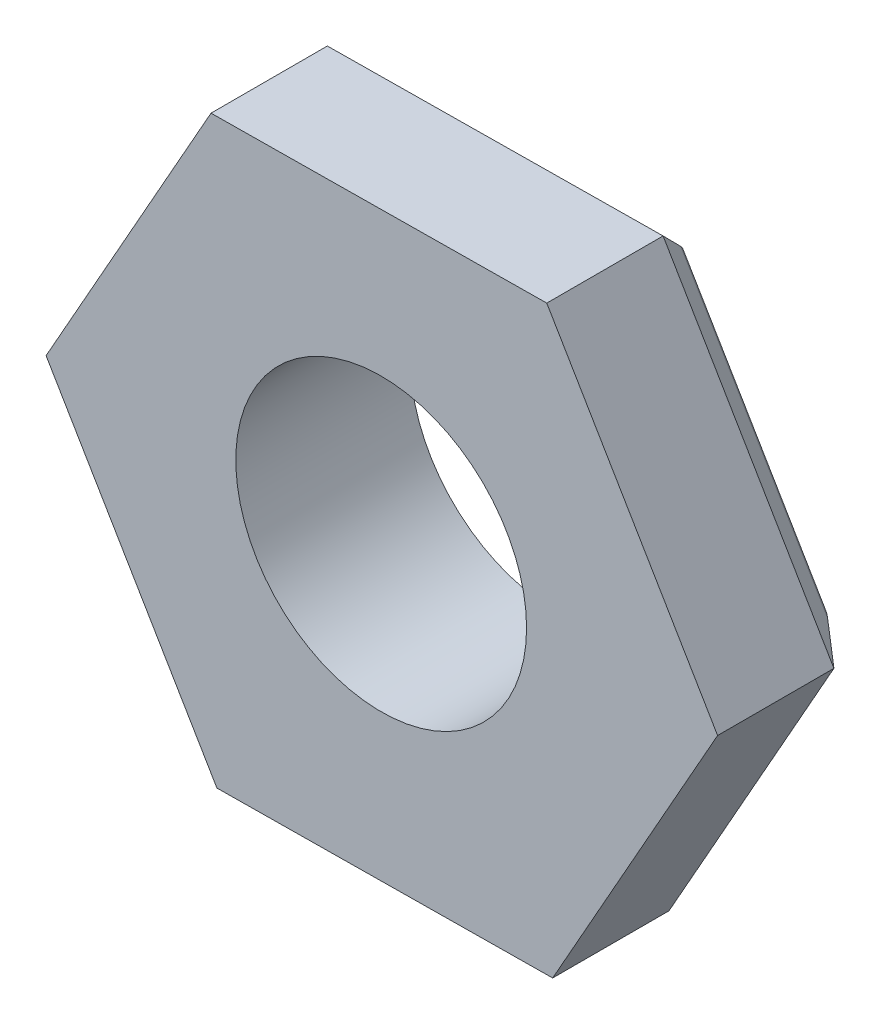
ISO-10303-21;
HEADER;
FILE_DESCRIPTION(('STEP AP214'),'2;1');
FILE_NAME('part.step','',(''),(''),'','','');
FILE_SCHEMA(('AUTOMOTIVE_DESIGN { 1 0 10303 214 1 1 1 1 }'));
ENDSEC;
DATA;
#1=APPLICATION_CONTEXT('core data for automotive mechanical design processes');
#2=APPLICATION_PROTOCOL_DEFINITION('international standard','automotive_design',2000,#1);
#3=PRODUCT_CONTEXT('',#1,'mechanical');
#4=PRODUCT('Part','Part','',(#3));
#5=PRODUCT_RELATED_PRODUCT_CATEGORY('part','',(#4));
#6=PRODUCT_DEFINITION_FORMATION('','',#4);
#7=PRODUCT_DEFINITION_CONTEXT('part definition',#1,'design');
#8=PRODUCT_DEFINITION('design','',#6,#7);
#9=PRODUCT_DEFINITION_SHAPE('','',#8);
#10=(LENGTH_UNIT() NAMED_UNIT(*) SI_UNIT(.MILLI.,.METRE.));
#11=(NAMED_UNIT(*) PLANE_ANGLE_UNIT() SI_UNIT($,.RADIAN.));
#12=(NAMED_UNIT(*) SI_UNIT($,.STERADIAN.) SOLID_ANGLE_UNIT());
#13=UNCERTAINTY_MEASURE_WITH_UNIT(LENGTH_MEASURE(1.E-05),#10,'distance_accuracy_value','');
#14=(GEOMETRIC_REPRESENTATION_CONTEXT(3) GLOBAL_UNCERTAINTY_ASSIGNED_CONTEXT((#13)) GLOBAL_UNIT_ASSIGNED_CONTEXT((#10,
#11,#12)) REPRESENTATION_CONTEXT('',''));
#15=CARTESIAN_POINT('',(0.,0.,0.));
#16=DIRECTION('',(0.,0.,1.));
#17=DIRECTION('',(1.,0.,0.));
#18=AXIS2_PLACEMENT_3D('',#15,#16,#17);
#19=CARTESIAN_POINT('',(0.,0.,3.));
#20=DIRECTION('',(0.,0.,1.));
#21=DIRECTION('',(1.,0.,0.));
#22=AXIS2_PLACEMENT_3D('',#19,#20,#21);
#23=PLANE('',#22);
#24=DIRECTION('',(0.999948900288858,0.0101092438443055,0.));
#25=VECTOR('',#24,1.);
#26=CARTESIAN_POINT('',(-58.2290926661635,17.9186617494503,3.));
#27=LINE('',#26,#25);
#28=CARTESIAN_POINT('',(-58.2290926661635,17.9186617494503,3.));
#29=VERTEX_POINT('',#28);
#30=CARTESIAN_POINT('',(-52.4558849985871,17.9770274959984,3.));
#31=VERTEX_POINT('',#30);
#32=EDGE_CURVE('E154',#29,#31,#27,.T.);
#33=ORIENTED_EDGE('',*,*,#32,.T.);
#34=DIRECTION('',(0.491219588162209,0.871035772058616,0.));
#35=VECTOR('',#34,1.);
#36=CARTESIAN_POINT('',(-52.4558849985871,17.9770274959984,3.));
#37=LINE('',#36,#35);
#38=CARTESIAN_POINT('',(-49.6198273840204,23.0059548707167,3.));
#39=VERTEX_POINT('',#38);
#40=EDGE_CURVE('E143',#31,#39,#37,.T.);
#41=ORIENTED_EDGE('',*,*,#40,.T.);
#42=DIRECTION('',(-0.508729312126651,0.86092652821431,0.));
#43=VECTOR('',#42,1.);
#44=CARTESIAN_POINT('',(-49.6198273840204,23.0059548707167,3.));
#45=LINE('',#44,#43);
#46=CARTESIAN_POINT('',(-52.5569774370302,27.976516498887,3.));
#47=VERTEX_POINT('',#46);
#48=EDGE_CURVE('E153',#39,#47,#45,.T.);
#49=ORIENTED_EDGE('',*,*,#48,.T.);
#50=DIRECTION('',(-0.999948900288858,-0.0101092438443049,0.));
#51=VECTOR('',#50,1.);
#52=CARTESIAN_POINT('',(-52.5569774370302,27.976516498887,3.));
#53=LINE('',#52,#51);
#54=CARTESIAN_POINT('',(-58.3301851046066,27.9181507523388,3.));
#55=VERTEX_POINT('',#54);
#56=EDGE_CURVE('E276',#47,#55,#53,.T.);
#57=ORIENTED_EDGE('',*,*,#56,.T.);
#58=DIRECTION('',(-0.491219588162209,-0.871035772058616,0.));
#59=VECTOR('',#58,1.);
#60=CARTESIAN_POINT('',(-58.3301851046066,27.9181507523388,3.));
#61=LINE('',#60,#59);
#62=CARTESIAN_POINT('',(-61.1662427191733,22.8892233776205,3.));
#63=VERTEX_POINT('',#62);
#64=EDGE_CURVE('E278',#55,#63,#61,.T.);
#65=ORIENTED_EDGE('',*,*,#64,.T.);
#66=DIRECTION('',(0.508729312126648,-0.860926528214311,0.));
#67=VECTOR('',#66,1.);
#68=CARTESIAN_POINT('',(-61.1662427191733,22.8892233776205,3.));
#69=LINE('',#68,#67);
#70=EDGE_CURVE('E159',#63,#29,#69,.T.);
#71=ORIENTED_EDGE('',*,*,#70,.T.);
#72=EDGE_LOOP('',(#33,#41,#49,#57,#65,#71));
#73=FACE_BOUND('',#72,.T.);
#74=CARTESIAN_POINT('',(-55.4042376193708,22.9665473157861,3.));
#75=DIRECTION('',(0.,0.,1.));
#76=DIRECTION('',(1.,0.,0.));
#77=AXIS2_PLACEMENT_3D('',#74,#75,#76);
#78=CIRCLE('',#77,2.5);
#79=CARTESIAN_POINT('',(-52.9042376193708,22.9665473157861,3.));
#80=VERTEX_POINT('',#79);
#81=EDGE_CURVE('E192',#80,#80,#78,.F.);
#82=ORIENTED_EDGE('',*,*,#81,.T.);
#83=EDGE_LOOP('',(#82));
#84=FACE_BOUND('',#83,.T.);
#85=ADVANCED_FACE('F35',(#73,#84),#23,.T.);
#86=CARTESIAN_POINT('',(0.,0.,0.));
#87=DIRECTION('',(0.,0.,1.));
#88=DIRECTION('',(1.,0.,0.));
#89=AXIS2_PLACEMENT_3D('',#86,#87,#88);
#90=PLANE('',#89);
#91=DIRECTION('',(0.508729312126648,-0.860926528214311,0.));
#92=VECTOR('',#91,1.);
#93=CARTESIAN_POINT('',(-59.6549937414648,23.1116191075897,0.));
#94=LINE('',#93,#92);
#95=CARTESIAN_POINT('',(-57.4269344377252,19.3410572089535,0.));
#96=VERTEX_POINT('',#95);
#97=CARTESIAN_POINT('',(-59.5333330027967,22.9057317036898,0.));
#98=VERTEX_POINT('',#97);
#99=EDGE_CURVE('E188',#96,#98,#94,.F.);
#100=ORIENTED_EDGE('',*,*,#99,.T.);
#101=DIRECTION('',(-0.491219588162209,-0.871035772058616,0.));
#102=VECTOR('',#101,1.);
#103=CARTESIAN_POINT('',(-57.3819602639058,26.7205686111847,0.));
#104=LINE('',#103,#102);
#105=CARTESIAN_POINT('',(-57.4994336166683,26.5122636189049,0.));
#106=VERTEX_POINT('',#105);
#107=EDGE_CURVE('E235',#98,#106,#104,.F.);
#108=ORIENTED_EDGE('',*,*,#107,.T.);
#109=DIRECTION('',(-0.999948900288858,-0.0101092438443049,0.));
#110=VECTOR('',#109,1.);
#111=CARTESIAN_POINT('',(-53.1200015740378,26.5565386277636,0.));
#112=LINE('',#111,#110);
#113=CARTESIAN_POINT('',(-53.3591356654685,26.5541210393838,0.));
#114=VERTEX_POINT('',#113);
#115=EDGE_CURVE('E233',#106,#114,#112,.F.);
#116=ORIENTED_EDGE('',*,*,#115,.T.);
#117=DIRECTION('',(-0.508729312126651,0.86092652821431,0.));
#118=VECTOR('',#117,1.);
#119=CARTESIAN_POINT('',(-51.1310763617288,22.7835591407475,0.));
#120=LINE('',#119,#118);
#121=CARTESIAN_POINT('',(-51.252737100397,22.9894465446475,0.));
#122=VERTEX_POINT('',#121);
#123=EDGE_CURVE('E231',#114,#122,#120,.F.);
#124=ORIENTED_EDGE('',*,*,#123,.T.);
#125=DIRECTION('',(0.491219588162209,0.871035772058616,0.));
#126=VECTOR('',#125,1.);
#127=CARTESIAN_POINT('',(-53.4041098392878,19.1746096371526,0.));
#128=LINE('',#127,#126);
#129=CARTESIAN_POINT('',(-53.2866364865253,19.3829146294323,0.));
#130=VERTEX_POINT('',#129);
#131=EDGE_CURVE('E229',#122,#130,#128,.F.);
#132=ORIENTED_EDGE('',*,*,#131,.T.);
#133=DIRECTION('',(0.999948900288858,0.0101092438443055,0.));
#134=VECTOR('',#133,1.);
#135=CARTESIAN_POINT('',(-57.1878003462945,19.3434747973333,0.));
#136=LINE('',#135,#134);
#137=EDGE_CURVE('E227',#130,#96,#136,.F.);
#138=ORIENTED_EDGE('',*,*,#137,.T.);
#139=EDGE_LOOP('',(#100,#108,#116,#124,#132,#138));
#140=FACE_BOUND('',#139,.T.);
#141=CARTESIAN_POINT('',(-55.4042376193708,22.9665473157861,0.));
#142=DIRECTION('',(0.,0.,1.));
#143=DIRECTION('',(1.,0.,0.));
#144=AXIS2_PLACEMENT_3D('',#141,#142,#143);
#145=CIRCLE('',#144,2.5);
#146=CARTESIAN_POINT('',(-52.9042376193708,22.9665473157861,0.));
#147=VERTEX_POINT('',#146);
#148=EDGE_CURVE('E264',#147,#147,#145,.T.);
#149=ORIENTED_EDGE('',*,*,#148,.T.);
#150=EDGE_LOOP('',(#149));
#151=FACE_BOUND('',#150,.T.);
#152=ADVANCED_FACE('F351',(#140,#151),#90,.F.);
#153=CARTESIAN_POINT('',(-58.2290926661635,17.9186617494503,3.));
#154=DIRECTION('',(-0.0101092438443055,0.999948900288858,0.));
#155=DIRECTION('',(-0.999948900288858,-0.0101092438443055,0.));
#156=AXIS2_PLACEMENT_3D('',#153,#154,#155);
#157=PLANE('',#156);
#158=DIRECTION('',(0.,0.,-1.));
#159=VECTOR('',#158,1.);
#160=CARTESIAN_POINT('',(-58.2290926661635,17.9186617494503,3.));
#161=LINE('',#160,#159);
#162=CARTESIAN_POINT('',(-58.2290926661635,17.9186617494503,1.0913379068408));
#163=VERTEX_POINT('',#162);
#164=EDGE_CURVE('E281',#29,#163,#161,.T.);
#165=ORIENTED_EDGE('',*,*,#164,.T.);
#166=CARTESIAN_POINT('',(-58.2290926661635,17.9186617494503,2.41421356237309));
#167=DIRECTION('',(-0.0101092438443055,0.999948900288858,0.));
#168=DIRECTION('',(0.499974450144429,0.00505462192215277,-0.866025403784439));
#169=AXIS2_PLACEMENT_3D('',#166,#167,#168);
#170=ELLIPSE('',#169,1.52752523165194,1.);
#171=CARTESIAN_POINT('',(-57.8208652370694,17.9227888309676,1.));
#172=VERTEX_POINT('',#171);
#173=EDGE_CURVE('E225',#163,#172,#170,.F.);
#174=ORIENTED_EDGE('',*,*,#173,.T.);
#175=DIRECTION('',(0.999948900288858,0.0101092438443055,0.));
#176=VECTOR('',#175,1.);
#177=CARTESIAN_POINT('',(-58.2290926661635,17.9186617494503,1.));
#178=LINE('',#177,#176);
#179=CARTESIAN_POINT('',(-52.4558849985871,17.9770274959984,1.));
#180=VERTEX_POINT('',#179);
#181=EDGE_CURVE('E167',#172,#180,#178,.T.);
#182=ORIENTED_EDGE('',*,*,#181,.T.);
#183=DIRECTION('',(0.,0.,-1.));
#184=VECTOR('',#183,1.);
#185=CARTESIAN_POINT('',(-52.4558849985871,17.9770274959984,3.));
#186=LINE('',#185,#184);
#187=EDGE_CURVE('E147',#31,#180,#186,.T.);
#188=ORIENTED_EDGE('',*,*,#187,.F.);
#189=ORIENTED_EDGE('',*,*,#32,.F.);
#190=EDGE_LOOP('',(#165,#174,#182,#188,#189));
#191=FACE_BOUND('',#190,.T.);
#192=ADVANCED_FACE('F165',(#191),#157,.F.);
#193=CARTESIAN_POINT('',(-52.4558849985871,17.9770274959984,3.));
#194=DIRECTION('',(-0.871035772058616,0.49121958816221,0.));
#195=DIRECTION('',(-0.49121958816221,-0.871035772058616,0.));
#196=AXIS2_PLACEMENT_3D('',#193,#194,#195);
#197=PLANE('',#196);
#198=ORIENTED_EDGE('',*,*,#187,.T.);
#199=DIRECTION('',(0.49121958816221,0.871035772058616,0.));
#200=VECTOR('',#199,1.);
#201=CARTESIAN_POINT('',(-52.4558849985871,17.9770274959984,1.));
#202=LINE('',#201,#200);
#203=CARTESIAN_POINT('',(-49.6198273840204,23.0059548707167,1.));
#204=VERTEX_POINT('',#203);
#205=EDGE_CURVE('E186',#180,#204,#202,.T.);
#206=ORIENTED_EDGE('',*,*,#205,.T.);
#207=DIRECTION('',(0.,0.,-1.));
#208=VECTOR('',#207,1.);
#209=CARTESIAN_POINT('',(-49.6198273840204,23.0059548707167,3.));
#210=LINE('',#209,#208);
#211=EDGE_CURVE('E150',#39,#204,#210,.T.);
#212=ORIENTED_EDGE('',*,*,#211,.F.);
#213=ORIENTED_EDGE('',*,*,#40,.F.);
#214=EDGE_LOOP('',(#198,#206,#212,#213));
#215=FACE_BOUND('',#214,.T.);
#216=ADVANCED_FACE('F145',(#215),#197,.F.);
#217=CARTESIAN_POINT('',(-49.6198273840204,23.0059548707167,3.));
#218=DIRECTION('',(-0.86092652821431,-0.508729312126651,0.));
#219=DIRECTION('',(0.508729312126651,-0.86092652821431,0.));
#220=AXIS2_PLACEMENT_3D('',#217,#218,#219);
#221=PLANE('',#220);
#222=ORIENTED_EDGE('',*,*,#211,.T.);
#223=DIRECTION('',(-0.508729312126651,0.86092652821431,0.));
#224=VECTOR('',#223,1.);
#225=CARTESIAN_POINT('',(-49.6198273840204,23.0059548707167,1.));
#226=LINE('',#225,#224);
#227=CARTESIAN_POINT('',(-52.5569774370302,27.976516498887,1.));
#228=VERTEX_POINT('',#227);
#229=EDGE_CURVE('E168',#204,#228,#226,.T.);
#230=ORIENTED_EDGE('',*,*,#229,.T.);
#231=DIRECTION('',(0.,0.,-1.));
#232=VECTOR('',#231,1.);
#233=CARTESIAN_POINT('',(-52.5569774370302,27.976516498887,3.));
#234=LINE('',#233,#232);
#235=EDGE_CURVE('E173',#47,#228,#234,.T.);
#236=ORIENTED_EDGE('',*,*,#235,.F.);
#237=ORIENTED_EDGE('',*,*,#48,.F.);
#238=EDGE_LOOP('',(#222,#230,#236,#237));
#239=FACE_BOUND('',#238,.T.);
#240=ADVANCED_FACE('F296',(#239),#221,.F.);
#241=CARTESIAN_POINT('',(-52.5569774370302,27.976516498887,3.));
#242=DIRECTION('',(0.0101092438443049,-0.999948900288858,0.));
#243=DIRECTION('',(0.999948900288858,0.0101092438443049,0.));
#244=AXIS2_PLACEMENT_3D('',#241,#242,#243);
#245=PLANE('',#244);
#246=ORIENTED_EDGE('',*,*,#235,.T.);
#247=DIRECTION('',(-0.999948900288858,-0.0101092438443049,0.));
#248=VECTOR('',#247,1.);
#249=CARTESIAN_POINT('',(-52.5569774370302,27.976516498887,1.));
#250=LINE('',#249,#248);
#251=CARTESIAN_POINT('',(-58.3301851046066,27.9181507523388,1.));
#252=VERTEX_POINT('',#251);
#253=EDGE_CURVE('E171',#228,#252,#250,.T.);
#254=ORIENTED_EDGE('',*,*,#253,.T.);
#255=DIRECTION('',(0.,0.,-1.));
#256=VECTOR('',#255,1.);
#257=CARTESIAN_POINT('',(-58.3301851046066,27.9181507523388,3.));
#258=LINE('',#257,#256);
#259=EDGE_CURVE('E286',#55,#252,#258,.T.);
#260=ORIENTED_EDGE('',*,*,#259,.F.);
#261=ORIENTED_EDGE('',*,*,#56,.F.);
#262=EDGE_LOOP('',(#246,#254,#260,#261));
#263=FACE_BOUND('',#262,.T.);
#264=ADVANCED_FACE('F292',(#263),#245,.F.);
#265=CARTESIAN_POINT('',(-58.3301851046066,27.9181507523388,3.));
#266=DIRECTION('',(0.871035772058616,-0.491219588162209,0.));
#267=DIRECTION('',(0.491219588162209,0.871035772058616,0.));
#268=AXIS2_PLACEMENT_3D('',#265,#266,#267);
#269=PLANE('',#268);
#270=DIRECTION('',(-0.491219588162209,-0.871035772058616,0.));
#271=VECTOR('',#270,1.);
#272=CARTESIAN_POINT('',(-58.3301851046066,27.9181507523388,1.));
#273=LINE('',#272,#271);
#274=CARTESIAN_POINT('',(-60.9657031620637,23.2448222424963,1.));
#275=VERTEX_POINT('',#274);
#276=EDGE_CURVE('E179',#252,#275,#273,.T.);
#277=ORIENTED_EDGE('',*,*,#276,.T.);
#278=CARTESIAN_POINT('',(-61.1662427191733,22.8892233776205,2.41421356237309));
#279=DIRECTION('',(0.871035772058616,-0.491219588162209,0.));
#280=DIRECTION('',(-0.245609794081105,-0.435517886029309,0.866025403784438));
#281=AXIS2_PLACEMENT_3D('',#278,#279,#280);
#282=ELLIPSE('',#281,1.52752523165194,1.);
#283=CARTESIAN_POINT('',(-61.1662427191733,22.8892233776205,1.0913379068408));
#284=VERTEX_POINT('',#283);
#285=EDGE_CURVE('E207',#275,#284,#282,.F.);
#286=ORIENTED_EDGE('',*,*,#285,.T.);
#287=DIRECTION('',(0.,0.,-1.));
#288=VECTOR('',#287,1.);
#289=CARTESIAN_POINT('',(-61.1662427191733,22.8892233776205,3.));
#290=LINE('',#289,#288);
#291=EDGE_CURVE('E283',#63,#284,#290,.T.);
#292=ORIENTED_EDGE('',*,*,#291,.F.);
#293=ORIENTED_EDGE('',*,*,#64,.F.);
#294=ORIENTED_EDGE('',*,*,#259,.T.);
#295=EDGE_LOOP('',(#277,#286,#292,#293,#294));
#296=FACE_BOUND('',#295,.T.);
#297=ADVANCED_FACE('F327',(#296),#269,.F.);
#298=CARTESIAN_POINT('',(-61.1662427191733,22.8892233776205,3.));
#299=DIRECTION('',(0.860926528214311,0.508729312126648,0.));
#300=DIRECTION('',(-0.508729312126648,0.860926528214311,0.));
#301=AXIS2_PLACEMENT_3D('',#298,#299,#300);
#302=PLANE('',#301);
#303=ORIENTED_EDGE('',*,*,#291,.T.);
#304=CARTESIAN_POINT('',(-61.1662427191733,22.8892233776205,2.41421356237309));
#305=DIRECTION('',(0.860926528214311,0.508729312126648,0.));
#306=DIRECTION('',(-0.254364656063325,0.430463264107157,0.866025403784438));
#307=AXIS2_PLACEMENT_3D('',#304,#305,#306);
#308=ELLIPSE('',#307,1.52752523165194,1.);
#309=CARTESIAN_POINT('',(-60.9585548471887,22.537751594262,1.));
#310=VERTEX_POINT('',#309);
#311=EDGE_CURVE('E211',#284,#310,#308,.F.);
#312=ORIENTED_EDGE('',*,*,#311,.T.);
#313=DIRECTION('',(0.508729312126648,-0.860926528214311,0.));
#314=VECTOR('',#313,1.);
#315=CARTESIAN_POINT('',(-61.1662427191733,22.8892233776205,1.));
#316=LINE('',#315,#314);
#317=CARTESIAN_POINT('',(-58.4367805381481,18.2701335328087,1.));
#318=VERTEX_POINT('',#317);
#319=EDGE_CURVE('E182',#310,#318,#316,.T.);
#320=ORIENTED_EDGE('',*,*,#319,.T.);
#321=CARTESIAN_POINT('',(-58.2290926661635,17.9186617494503,2.41421356237309));
#322=DIRECTION('',(0.860926528214311,0.508729312126648,0.));
#323=DIRECTION('',(-0.254364656063326,0.43046326410716,-0.866025403784436));
#324=AXIS2_PLACEMENT_3D('',#321,#322,#323);
#325=ELLIPSE('',#324,1.52752523165195,1.);
#326=EDGE_CURVE('E209',#318,#163,#325,.F.);
#327=ORIENTED_EDGE('',*,*,#326,.T.);
#328=ORIENTED_EDGE('',*,*,#164,.F.);
#329=ORIENTED_EDGE('',*,*,#70,.F.);
#330=EDGE_LOOP('',(#303,#312,#320,#327,#328,#329));
#331=FACE_BOUND('',#330,.T.);
#332=ADVANCED_FACE('F331',(#331),#302,.F.);
#333=CARTESIAN_POINT('',(-61.1662427191733,22.8892233776205,1.));
#334=DIRECTION('',(0.60876698620373,0.35972594639312,0.707106781186549));
#335=DIRECTION('',(0.508729312126648,-0.860926528214311,0.));
#336=AXIS2_PLACEMENT_3D('',#333,#334,#335);
#337=PLANE('',#336);
#338=ORIENTED_EDGE('',*,*,#319,.F.);
#339=DIRECTION('',(0.75589031826767,0.00764187004426861,-0.654653670707976));
#340=VECTOR('',#339,1.);
#341=CARTESIAN_POINT('',(-61.0751912555013,22.5365724281142,1.10101525445522));
#342=LINE('',#341,#340);
#343=CARTESIAN_POINT('',(-60.1420999890004,22.5460057572967,0.292893218813446));
#344=VERTEX_POINT('',#343);
#345=EDGE_CURVE('E215',#310,#344,#342,.T.);
#346=ORIENTED_EDGE('',*,*,#345,.T.);
#347=DIRECTION('',(-0.508729312126648,0.860926528214311,0.));
#348=VECTOR('',#347,1.);
#349=CARTESIAN_POINT('',(-57.9140406852607,18.7754438586604,0.292893218813447));
#350=LINE('',#349,#348);
#351=CARTESIAN_POINT('',(-58.0357014239289,18.9813312625603,0.292893218813447));
#352=VERTEX_POINT('',#351);
#353=EDGE_CURVE('E199',#344,#352,#350,.F.);
#354=ORIENTED_EDGE('',*,*,#353,.T.);
#355=DIRECTION('',(-0.371327105543077,-0.658441153116643,0.654653670707975));
#356=VECTOR('',#355,1.);
#357=CARTESIAN_POINT('',(-57.6837753788746,19.6053702499066,-0.327556174116219));
#358=LINE('',#357,#356);
#359=EDGE_CURVE('E213',#352,#318,#358,.T.);
#360=ORIENTED_EDGE('',*,*,#359,.T.);
#361=EDGE_LOOP('',(#338,#346,#354,#360));
#362=FACE_BOUND('',#361,.T.);
#363=ADVANCED_FACE('F363',(#362),#337,.F.);
#364=CARTESIAN_POINT('',(-58.2290926661635,17.9186617494503,1.));
#365=DIRECTION('',(-0.00714831487497678,0.70707064823428,0.70710678118655));
#366=DIRECTION('',(0.999948900288858,0.0101092438443055,0.));
#367=AXIS2_PLACEMENT_3D('',#364,#365,#366);
#368=PLANE('',#367);
#369=ORIENTED_EDGE('',*,*,#181,.F.);
#370=DIRECTION('',(-0.371327105543077,-0.658441153116643,0.654653670707975));
#371=VECTOR('',#370,1.);
#372=CARTESIAN_POINT('',(-57.8781622533864,17.8211891552888,1.10101525445522));
#373=LINE('',#372,#371);
#374=CARTESIAN_POINT('',(-57.4197861228502,18.6339865607192,0.29289321881345));
#375=VERTEX_POINT('',#374);
#376=EDGE_CURVE('E223',#172,#375,#373,.F.);
#377=ORIENTED_EDGE('',*,*,#376,.T.);
#378=DIRECTION('',(-0.999948900288858,-0.0101092438443055,0.));
#379=VECTOR('',#378,1.);
#380=CARTESIAN_POINT('',(-53.0403540802197,18.6782615695779,0.29289321881345));
#381=LINE('',#380,#379);
#382=CARTESIAN_POINT('',(-52.8712607425562,18.6799710627154,0.292893218813451));
#383=VERTEX_POINT('',#382);
#384=EDGE_CURVE('E221',#375,#383,#381,.F.);
#385=ORIENTED_EDGE('',*,*,#384,.T.);
#386=DIRECTION('',(-0.384563212724584,0.650799283072376,-0.654653670707977));
#387=VECTOR('',#386,1.);
#388=CARTESIAN_POINT('',(-52.4558849985871,17.9770274959984,1.));
#389=LINE('',#388,#387);
#390=EDGE_CURVE('E163',#180,#383,#389,.T.);
#391=ORIENTED_EDGE('',*,*,#390,.F.);
#392=EDGE_LOOP('',(#369,#377,#385,#391));
#393=FACE_BOUND('',#392,.T.);
#394=ADVANCED_FACE('F338',(#393),#368,.F.);
#395=CARTESIAN_POINT('',(-58.3301851046066,27.9181507523388,1.));
#396=DIRECTION('',(0.615915301078706,-0.347344701841161,0.707106781186549));
#397=DIRECTION('',(-0.491219588162209,-0.871035772058616,0.));
#398=AXIS2_PLACEMENT_3D('',#395,#396,#397);
#399=PLANE('',#398);
#400=DIRECTION('',(0.491219588162209,0.871035772058616,0.));
#401=VECTOR('',#400,1.);
#402=CARTESIAN_POINT('',(-60.0317749511129,23.4613813978107,0.292893218813456));
#403=LINE('',#402,#401);
#404=CARTESIAN_POINT('',(-57.9148093606374,27.2152071856219,0.292893218813452));
#405=VERTEX_POINT('',#404);
#406=CARTESIAN_POINT('',(-60.1492483038754,23.2530764055309,0.292893218813456));
#407=VERTEX_POINT('',#406);
#408=EDGE_CURVE('E202',#405,#407,#403,.F.);
#409=ORIENTED_EDGE('',*,*,#408,.T.);
#410=DIRECTION('',(0.75589031826767,0.00764187004426862,-0.654653670707976));
#411=VECTOR('',#410,1.);
#412=CARTESIAN_POINT('',(-59.4328516653544,23.2603190039337,-0.3275561741162));
#413=LINE('',#412,#411);
#414=EDGE_CURVE('E204',#407,#275,#413,.F.);
#415=ORIENTED_EDGE('',*,*,#414,.T.);
#416=ORIENTED_EDGE('',*,*,#276,.F.);
#417=DIRECTION('',(0.384563212724592,-0.650799283072372,-0.654653670707976));
#418=VECTOR('',#417,1.);
#419=CARTESIAN_POINT('',(-58.3301851046066,27.9181507523388,1.));
#420=LINE('',#419,#418);
#421=EDGE_CURVE('E194',#405,#252,#420,.F.);
#422=ORIENTED_EDGE('',*,*,#421,.F.);
#423=EDGE_LOOP('',(#409,#415,#416,#422));
#424=FACE_BOUND('',#423,.T.);
#425=ADVANCED_FACE('F308',(#424),#399,.F.);
#426=CARTESIAN_POINT('',(-52.4558849985871,17.9770274959984,1.));
#427=DIRECTION('',(-0.615915301078709,0.347344701841162,0.707106781186546));
#428=DIRECTION('',(0.49121958816221,0.871035772058616,0.));
#429=AXIS2_PLACEMENT_3D('',#426,#427,#428);
#430=PLANE('',#429);
#431=ORIENTED_EDGE('',*,*,#390,.T.);
#432=DIRECTION('',(-0.49121958816221,-0.871035772058616,0.));
#433=VECTOR('',#432,1.);
#434=CARTESIAN_POINT('',(-50.5193484465558,22.8504068350861,0.292893218813455));
#435=LINE('',#434,#433);
#436=CARTESIAN_POINT('',(-50.4362822422087,22.9977007076821,0.292893218813454));
#437=VERTEX_POINT('',#436);
#438=EDGE_CURVE('E11',#383,#437,#435,.F.);
#439=ORIENTED_EDGE('',*,*,#438,.T.);
#440=DIRECTION('',(0.755890318267669,0.00764187004427287,0.654653670707978));
#441=VECTOR('',#440,1.);
#442=CARTESIAN_POINT('',(-51.2693152890423,22.9892789431316,-0.428571428571444));
#443=LINE('',#442,#441);
#444=EDGE_CURVE('E191',#204,#437,#443,.F.);
#445=ORIENTED_EDGE('',*,*,#444,.F.);
#446=ORIENTED_EDGE('',*,*,#205,.F.);
#447=EDGE_LOOP('',(#431,#439,#445,#446));
#448=FACE_BOUND('',#447,.T.);
#449=ADVANCED_FACE('F341',(#448),#430,.F.);
#450=CARTESIAN_POINT('',(-52.5569774370302,27.976516498887,1.));
#451=DIRECTION('',(0.00714831487497637,-0.707070648234281,0.707106781186549));
#452=DIRECTION('',(-0.999948900288858,-0.0101092438443049,0.));
#453=AXIS2_PLACEMENT_3D('',#450,#451,#452);
#454=PLANE('',#453);
#455=DIRECTION('',(-0.371327105543076,-0.658441153116642,-0.654653670707977));
#456=VECTOR('',#455,1.);
#457=CARTESIAN_POINT('',(-52.5569774370302,27.976516498887,1.));
#458=LINE('',#457,#456);
#459=CARTESIAN_POINT('',(-52.9580565512493,27.2653187691354,0.292893218813452));
#460=VERTEX_POINT('',#459);
#461=EDGE_CURVE('E189',#460,#228,#458,.F.);
#462=ORIENTED_EDGE('',*,*,#461,.F.);
#463=DIRECTION('',(0.999948900288858,0.0101092438443049,0.));
#464=VECTOR('',#463,1.);
#465=CARTESIAN_POINT('',(-57.7457160229739,27.2169166787594,0.292893218813448));
#466=LINE('',#465,#464);
#467=EDGE_CURVE('E237',#460,#405,#466,.F.);
#468=ORIENTED_EDGE('',*,*,#467,.T.);
#469=ORIENTED_EDGE('',*,*,#421,.T.);
#470=ORIENTED_EDGE('',*,*,#253,.F.);
#471=EDGE_LOOP('',(#462,#468,#469,#470));
#472=FACE_BOUND('',#471,.T.);
#473=ADVANCED_FACE('F302',(#472),#454,.F.);
#474=CARTESIAN_POINT('',(-49.6198273840204,23.0059548707167,1.));
#475=DIRECTION('',(-0.60876698620373,-0.359725946393122,0.707106781186547));
#476=DIRECTION('',(-0.508729312126651,0.86092652821431,0.));
#477=AXIS2_PLACEMENT_3D('',#474,#475,#476);
#478=PLANE('',#477);
#479=ORIENTED_EDGE('',*,*,#444,.T.);
#480=DIRECTION('',(0.508729312126651,-0.86092652821431,0.));
#481=VECTOR('',#480,1.);
#482=CARTESIAN_POINT('',(-52.8720294179329,27.1197343896768,0.292893218813452));
#483=LINE('',#482,#481);
#484=EDGE_CURVE('E44',#437,#460,#483,.F.);
#485=ORIENTED_EDGE('',*,*,#484,.T.);
#486=ORIENTED_EDGE('',*,*,#461,.T.);
#487=ORIENTED_EDGE('',*,*,#229,.F.);
#488=EDGE_LOOP('',(#479,#485,#486,#487));
#489=FACE_BOUND('',#488,.T.);
#490=ADVANCED_FACE('F298',(#489),#478,.F.);
#491=CARTESIAN_POINT('',(-34.0935588148514,-20.1461938451398,1.));
#492=DIRECTION('',(-0.508729312126648,0.860926528214311,0.));
#493=DIRECTION('',(-0.860926528214311,-0.508729312126648,0.));
#494=AXIS2_PLACEMENT_3D('',#491,#492,#493);
#495=CYLINDRICAL_SURFACE('',#494,1.);
#496=ORIENTED_EDGE('',*,*,#353,.F.);
#497=CARTESIAN_POINT('',(-59.5333330027967,22.9057317036898,1.));
#498=DIRECTION('',(-0.508729312126648,0.860926528214311,0.));
#499=DIRECTION('',(-0.860926528214311,-0.508729312126648,0.));
#500=AXIS2_PLACEMENT_3D('',#497,#498,#499);
#501=CIRCLE('',#500,1.);
#502=EDGE_CURVE('E219',#344,#98,#501,.F.);
#503=ORIENTED_EDGE('',*,*,#502,.T.);
#504=ORIENTED_EDGE('',*,*,#99,.F.);
#505=CARTESIAN_POINT('',(-57.4269344377252,19.3410572089535,1.));
#506=DIRECTION('',(-0.508729312126648,0.860926528214311,0.));
#507=DIRECTION('',(-0.860926528214311,-0.508729312126648,0.));
#508=AXIS2_PLACEMENT_3D('',#505,#506,#507);
#509=CIRCLE('',#508,1.);
#510=EDGE_CURVE('E217',#96,#352,#509,.T.);
#511=ORIENTED_EDGE('',*,*,#510,.T.);
#512=EDGE_LOOP('',(#496,#503,#504,#511));
#513=FACE_BOUND('',#512,.T.);
#514=ADVANCED_FACE('F375',(#513),#495,.T.);
#515=CARTESIAN_POINT('',(-55.4042376193708,22.9665473157861,5.));
#516=DIRECTION('',(0.,0.,-1.));
#517=DIRECTION('',(-1.,0.,0.));
#518=AXIS2_PLACEMENT_3D('',#515,#516,#517);
#519=CYLINDRICAL_SURFACE('',#518,2.5);
#520=ORIENTED_EDGE('',*,*,#81,.F.);
#521=EDGE_LOOP('',(#520));
#522=FACE_BOUND('',#521,.T.);
#523=ORIENTED_EDGE('',*,*,#148,.F.);
#524=EDGE_LOOP('',(#523));
#525=FACE_BOUND('',#524,.T.);
#526=ADVANCED_FACE('F359',(#522,#525),#519,.F.);
#527=CARTESIAN_POINT('',(-57.8853105682614,18.5282598035231,1.80812203564177));
#528=DIRECTION('',(0.371327105543077,0.658441153116643,-0.654653670707975));
#529=DIRECTION('',(0.,0.705064273892108,0.709143405582394));
#530=AXIS2_PLACEMENT_3D('',#527,#528,#529);
#531=CYLINDRICAL_SURFACE('',#530,1.);
#532=ORIENTED_EDGE('',*,*,#326,.F.);
#533=ORIENTED_EDGE('',*,*,#359,.F.);
#534=CARTESIAN_POINT('',(-57.4269344377252,19.3410572089535,0.999999999999996));
#535=DIRECTION('',(0.371327105543072,0.658441153116645,-0.654653670707976));
#536=DIRECTION('',(0.,0.705064273892107,0.709143405582394));
#537=AXIS2_PLACEMENT_3D('',#534,#535,#536);
#538=CIRCLE('',#537,1.);
#539=EDGE_CURVE('E39',#375,#352,#538,.T.);
#540=ORIENTED_EDGE('',*,*,#539,.F.);
#541=ORIENTED_EDGE('',*,*,#376,.F.);
#542=ORIENTED_EDGE('',*,*,#173,.F.);
#543=EDGE_LOOP('',(#532,#533,#540,#541,#542));
#544=FACE_BOUND('',#543,.T.);
#545=ADVANCED_FACE('F37',(#544),#531,.T.);
#546=CARTESIAN_POINT('',(-57.4269344377252,19.3410572089535,1.));
#547=DIRECTION('',(0.,0.,1.));
#548=DIRECTION('',(1.,0.,0.));
#549=AXIS2_PLACEMENT_3D('',#546,#547,#548);
#550=SPHERICAL_SURFACE('',#549,1.);
#551=ORIENTED_EDGE('',*,*,#539,.T.);
#552=ORIENTED_EDGE('',*,*,#510,.F.);
#553=CARTESIAN_POINT('',(-57.4269344377252,19.3410572089535,1.));
#554=DIRECTION('',(0.999948900288858,0.0101092438443083,0.));
#555=DIRECTION('',(-0.0101092438443083,0.999948900288858,0.));
#556=AXIS2_PLACEMENT_3D('',#553,#554,#555);
#557=CIRCLE('',#556,1.);
#558=EDGE_CURVE('E257',#375,#96,#557,.T.);
#559=ORIENTED_EDGE('',*,*,#558,.F.);
#560=EDGE_LOOP('',(#551,#552,#559));
#561=FACE_BOUND('',#560,.T.);
#562=ADVANCED_FACE('F407',(#561),#550,.T.);
#563=CARTESIAN_POINT('',(-0.201382321910459,19.9195938324716,1.));
#564=DIRECTION('',(-0.999948900288858,-0.0101092438443055,0.));
#565=DIRECTION('',(0.0101092438443055,-0.999948900288858,0.));
#566=AXIS2_PLACEMENT_3D('',#563,#564,#565);
#567=CYLINDRICAL_SURFACE('',#566,1.);
#568=ORIENTED_EDGE('',*,*,#558,.T.);
#569=ORIENTED_EDGE('',*,*,#137,.F.);
#570=CARTESIAN_POINT('',(-53.2866364865253,19.3829146294323,1.));
#571=DIRECTION('',(-0.860926528214311,-0.508729312126649,0.));
#572=DIRECTION('',(-0.508729312126649,0.860926528214311,0.));
#573=AXIS2_PLACEMENT_3D('',#570,#571,#572);
#574=ELLIPSE('',#573,1.15470053837925,1.);
#575=EDGE_CURVE('E255',#383,#130,#574,.F.);
#576=ORIENTED_EDGE('',*,*,#575,.F.);
#577=ORIENTED_EDGE('',*,*,#384,.F.);
#578=EDGE_LOOP('',(#568,#569,#576,#577));
#579=FACE_BOUND('',#578,.T.);
#580=ADVANCED_FACE('F404',(#579),#567,.T.);
#581=CARTESIAN_POINT('',(-48.7221122616903,27.4767772889698,1.));
#582=DIRECTION('',(-0.491219588162209,-0.871035772058616,0.));
#583=DIRECTION('',(0.871035772058616,-0.491219588162209,0.));
#584=AXIS2_PLACEMENT_3D('',#581,#582,#583);
#585=CYLINDRICAL_SURFACE('',#584,1.);
#586=ORIENTED_EDGE('',*,*,#575,.T.);
#587=ORIENTED_EDGE('',*,*,#131,.F.);
#588=CARTESIAN_POINT('',(-51.252737100397,22.9894465446475,1.));
#589=DIRECTION('',(0.0101092438443062,-0.999948900288858,0.));
#590=DIRECTION('',(-0.999948900288858,-0.0101092438443062,0.));
#591=AXIS2_PLACEMENT_3D('',#588,#589,#590);
#592=ELLIPSE('',#591,1.15470053837925,1.);
#593=EDGE_CURVE('E252',#437,#122,#592,.F.);
#594=ORIENTED_EDGE('',*,*,#593,.F.);
#595=ORIENTED_EDGE('',*,*,#438,.F.);
#596=EDGE_LOOP('',(#586,#587,#594,#595));
#597=FACE_BOUND('',#596,.T.);
#598=ADVANCED_FACE('F400',(#597),#585,.T.);
#599=CARTESIAN_POINT('',(-27.9193614775231,-16.4978045094459,1.));
#600=DIRECTION('',(0.508729312126651,-0.86092652821431,0.));
#601=DIRECTION('',(0.86092652821431,0.508729312126651,0.));
#602=AXIS2_PLACEMENT_3D('',#599,#600,#601);
#603=CYLINDRICAL_SURFACE('',#602,1.);
#604=ORIENTED_EDGE('',*,*,#593,.T.);
#605=ORIENTED_EDGE('',*,*,#123,.F.);
#606=CARTESIAN_POINT('',(-53.3591356654685,26.5541210393838,1.));
#607=DIRECTION('',(0.871035772058617,-0.491219588162208,0.));
#608=DIRECTION('',(-0.491219588162208,-0.871035772058617,0.));
#609=AXIS2_PLACEMENT_3D('',#606,#607,#608);
#610=ELLIPSE('',#609,1.15470053837925,1.);
#611=EDGE_CURVE('E249',#460,#114,#610,.F.);
#612=ORIENTED_EDGE('',*,*,#611,.F.);
#613=ORIENTED_EDGE('',*,*,#484,.F.);
#614=EDGE_LOOP('',(#604,#605,#612,#613));
#615=FACE_BOUND('',#614,.T.);
#616=ADVANCED_FACE('F397',(#615),#603,.T.);
#617=CARTESIAN_POINT('',(-0.27388150085359,27.090800242423,1.));
#618=DIRECTION('',(0.999948900288858,0.0101092438443049,0.));
#619=DIRECTION('',(-0.0101092438443049,0.999948900288858,0.));
#620=AXIS2_PLACEMENT_3D('',#617,#618,#619);
#621=CYLINDRICAL_SURFACE('',#620,1.);
#622=ORIENTED_EDGE('',*,*,#611,.T.);
#623=ORIENTED_EDGE('',*,*,#115,.F.);
#624=CARTESIAN_POINT('',(-57.4994336166683,26.5122636189049,1.));
#625=DIRECTION('',(0.860926528214311,0.508729312126649,0.));
#626=DIRECTION('',(0.508729312126649,-0.860926528214311,0.));
#627=AXIS2_PLACEMENT_3D('',#624,#625,#626);
#628=ELLIPSE('',#627,1.15470053837925,1.);
#629=EDGE_CURVE('E246',#405,#106,#628,.F.);
#630=ORIENTED_EDGE('',*,*,#629,.F.);
#631=ORIENTED_EDGE('',*,*,#467,.F.);
#632=EDGE_LOOP('',(#622,#623,#630,#631));
#633=FACE_BOUND('',#632,.T.);
#634=ADVANCED_FACE('F313',(#633),#621,.T.);
#635=CARTESIAN_POINT('',(-54.9688087779616,30.9995943632272,1.));
#636=DIRECTION('',(0.491219588162209,0.871035772058616,0.));
#637=DIRECTION('',(-0.871035772058616,0.491219588162209,0.));
#638=AXIS2_PLACEMENT_3D('',#635,#636,#637);
#639=CYLINDRICAL_SURFACE('',#638,1.);
#640=ORIENTED_EDGE('',*,*,#629,.T.);
#641=ORIENTED_EDGE('',*,*,#107,.F.);
#642=CARTESIAN_POINT('',(-59.5333330027967,22.9057317036898,1.00000000000001));
#643=DIRECTION('',(-0.491219588162211,-0.871035772058615,0.));
#644=DIRECTION('',(0.871035772058615,-0.491219588162211,0.));
#645=AXIS2_PLACEMENT_3D('',#642,#643,#644);
#646=CIRCLE('',#645,1.);
#647=EDGE_CURVE('E243',#407,#98,#646,.T.);
#648=ORIENTED_EDGE('',*,*,#647,.F.);
#649=ORIENTED_EDGE('',*,*,#408,.F.);
#650=EDGE_LOOP('',(#640,#641,#648,#649));
#651=FACE_BOUND('',#650,.T.);
#652=ADVANCED_FACE('F316',(#651),#639,.T.);
#653=CARTESIAN_POINT('',(-59.5333330027967,22.9057317036898,1.));
#654=DIRECTION('',(0.,0.,1.));
#655=DIRECTION('',(1.,0.,0.));
#656=AXIS2_PLACEMENT_3D('',#653,#654,#655);
#657=SPHERICAL_SURFACE('',#656,1.);
#658=ORIENTED_EDGE('',*,*,#647,.T.);
#659=ORIENTED_EDGE('',*,*,#502,.F.);
#660=CARTESIAN_POINT('',(-59.5333330027967,22.9057317036898,1.));
#661=DIRECTION('',(-0.755890318267671,-0.00764187004426992,0.654653670707975));
#662=DIRECTION('',(0.65467278683596,0.,0.755912390543003));
#663=AXIS2_PLACEMENT_3D('',#660,#661,#662);
#664=CIRCLE('',#663,1.);
#665=EDGE_CURVE('E240',#407,#344,#664,.T.);
#666=ORIENTED_EDGE('',*,*,#665,.F.);
#667=EDGE_LOOP('',(#658,#659,#666));
#668=FACE_BOUND('',#667,.T.);
#669=ADVANCED_FACE('F321',(#668),#657,.T.);
#670=CARTESIAN_POINT('',(-58.8169363642757,22.9129743020925,0.379550607070349));
#671=DIRECTION('',(-0.75589031826767,-0.0076418700442686,0.654653670707976));
#672=DIRECTION('',(0.654672786835961,0.,0.755912390543002));
#673=AXIS2_PLACEMENT_3D('',#670,#671,#672);
#674=CYLINDRICAL_SURFACE('',#673,1.);
#675=ORIENTED_EDGE('',*,*,#665,.T.);
#676=ORIENTED_EDGE('',*,*,#345,.F.);
#677=ORIENTED_EDGE('',*,*,#311,.F.);
#678=ORIENTED_EDGE('',*,*,#285,.F.);
#679=ORIENTED_EDGE('',*,*,#414,.F.);
#680=EDGE_LOOP('',(#675,#676,#677,#678,#679));
#681=FACE_BOUND('',#680,.T.);
#682=ADVANCED_FACE('F324',(#681),#674,.T.);
#683=CLOSED_SHELL('',(#85,#152,#192,#216,#240,#264,#297,#332,#363,#394,#425,#449,#473,#490,#514,
#526,#545,#562,#580,#598,#616,#634,#652,#669,#682));
#684=MANIFOLD_SOLID_BREP('B2',#683);
#685=ADVANCED_BREP_SHAPE_REPRESENTATION('',(#18,#684),#14);
#686=SHAPE_DEFINITION_REPRESENTATION(#9,#685);
ENDSEC;
END-ISO-10303-21;
